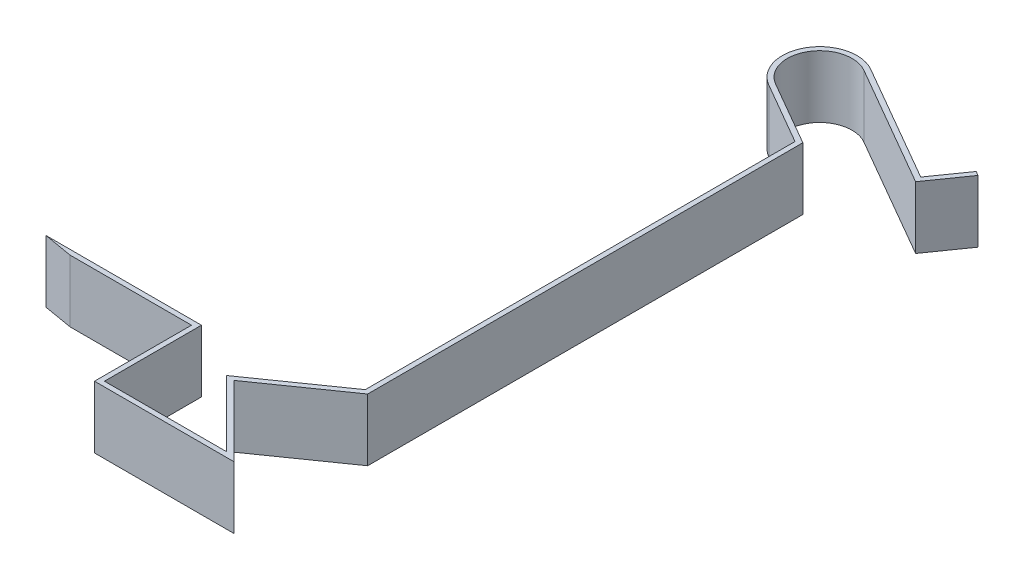
ISO-10303-21;
HEADER;
FILE_DESCRIPTION(('STEP AP214'),'2;1');
FILE_NAME('part.step','',(''),(''),'','','');
FILE_SCHEMA(('AUTOMOTIVE_DESIGN { 1 0 10303 214 1 1 1 1 }'));
ENDSEC;
DATA;
#1=APPLICATION_CONTEXT('core data for automotive mechanical design processes');
#2=APPLICATION_PROTOCOL_DEFINITION('international standard','automotive_design',2000,#1);
#3=PRODUCT_CONTEXT('',#1,'mechanical');
#4=PRODUCT('Part','Part','',(#3));
#5=PRODUCT_RELATED_PRODUCT_CATEGORY('part','',(#4));
#6=PRODUCT_DEFINITION_FORMATION('','',#4);
#7=PRODUCT_DEFINITION_CONTEXT('part definition',#1,'design');
#8=PRODUCT_DEFINITION('design','',#6,#7);
#9=PRODUCT_DEFINITION_SHAPE('','',#8);
#10=(LENGTH_UNIT() NAMED_UNIT(*) SI_UNIT(.MILLI.,.METRE.));
#11=(NAMED_UNIT(*) PLANE_ANGLE_UNIT() SI_UNIT($,.RADIAN.));
#12=(NAMED_UNIT(*) SI_UNIT($,.STERADIAN.) SOLID_ANGLE_UNIT());
#13=UNCERTAINTY_MEASURE_WITH_UNIT(LENGTH_MEASURE(1.E-05),#10,'distance_accuracy_value','');
#14=(GEOMETRIC_REPRESENTATION_CONTEXT(3) GLOBAL_UNCERTAINTY_ASSIGNED_CONTEXT((#13)) GLOBAL_UNIT_ASSIGNED_CONTEXT((#10,
#11,#12)) REPRESENTATION_CONTEXT('',''));
#15=CARTESIAN_POINT('',(0.,0.,0.));
#16=DIRECTION('',(0.,0.,1.));
#17=DIRECTION('',(1.,0.,0.));
#18=AXIS2_PLACEMENT_3D('',#15,#16,#17);
#19=CARTESIAN_POINT('',(-10.934737319455,2.5,-12.9348525920538));
#20=DIRECTION('',(0.168909576552276,0.,-0.985631551315668));
#21=DIRECTION('',(-0.985631551315668,0.,-0.168909576552276));
#22=AXIS2_PLACEMENT_3D('',#19,#20,#21);
#23=PLANE('',#22);
#24=DIRECTION('',(0.985631551315668,0.,0.168909576552276));
#25=VECTOR('',#24,1.);
#26=CARTESIAN_POINT('',(-10.934737319455,0.,-12.9348525920538));
#27=LINE('',#26,#25);
#28=CARTESIAN_POINT('',(-10.934737319455,0.,-12.9348525920538));
#29=VERTEX_POINT('',#28);
#30=CARTESIAN_POINT('',(-9.76768501675672,0.,-12.7348525920538));
#31=VERTEX_POINT('',#30);
#32=EDGE_CURVE('E225',#29,#31,#27,.T.);
#33=ORIENTED_EDGE('',*,*,#32,.T.);
#34=DIRECTION('',(0.,-1.,0.));
#35=VECTOR('',#34,1.);
#36=CARTESIAN_POINT('',(-9.76768501675672,2.5,-12.7348525920538));
#37=LINE('',#36,#35);
#38=CARTESIAN_POINT('',(-9.76768501675672,2.5,-12.7348525920538));
#39=VERTEX_POINT('',#38);
#40=EDGE_CURVE('E11',#39,#31,#37,.T.);
#41=ORIENTED_EDGE('',*,*,#40,.F.);
#42=DIRECTION('',(0.985631551315668,0.,0.168909576552276));
#43=VECTOR('',#42,1.);
#44=CARTESIAN_POINT('',(-10.934737319455,2.5,-12.9348525920538));
#45=LINE('',#44,#43);
#46=CARTESIAN_POINT('',(-10.934737319455,2.5,-12.9348525920538));
#47=VERTEX_POINT('',#46);
#48=EDGE_CURVE('E289',#47,#39,#45,.T.);
#49=ORIENTED_EDGE('',*,*,#48,.F.);
#50=DIRECTION('',(0.,-1.,0.));
#51=VECTOR('',#50,1.);
#52=CARTESIAN_POINT('',(-10.934737319455,2.5,-12.9348525920538));
#53=LINE('',#52,#51);
#54=EDGE_CURVE('E221',#47,#29,#53,.T.);
#55=ORIENTED_EDGE('',*,*,#54,.T.);
#56=EDGE_LOOP('',(#33,#41,#49,#55));
#57=FACE_BOUND('',#56,.T.);
#58=ADVANCED_FACE('F40',(#57),#23,.F.);
#59=CARTESIAN_POINT('',(-9.76768501675672,2.5,-12.7348525920538));
#60=DIRECTION('',(0.,0.,-1.));
#61=DIRECTION('',(-1.,0.,0.));
#62=AXIS2_PLACEMENT_3D('',#59,#60,#61);
#63=PLANE('',#62);
#64=DIRECTION('',(1.,0.,0.));
#65=VECTOR('',#64,1.);
#66=CARTESIAN_POINT('',(-9.76768501675672,0.,-12.7348525920538));
#67=LINE('',#66,#65);
#68=CARTESIAN_POINT('',(-4.88473731945503,0.,-12.7348525920538));
#69=VERTEX_POINT('',#68);
#70=EDGE_CURVE('E229',#31,#69,#67,.T.);
#71=ORIENTED_EDGE('',*,*,#70,.T.);
#72=DIRECTION('',(0.,-1.,0.));
#73=VECTOR('',#72,1.);
#74=CARTESIAN_POINT('',(-4.88473731945503,2.5,-12.7348525920538));
#75=LINE('',#74,#73);
#76=CARTESIAN_POINT('',(-4.88473731945503,2.5,-12.7348525920538));
#77=VERTEX_POINT('',#76);
#78=EDGE_CURVE('E49',#77,#69,#75,.T.);
#79=ORIENTED_EDGE('',*,*,#78,.F.);
#80=DIRECTION('',(1.,0.,0.));
#81=VECTOR('',#80,1.);
#82=CARTESIAN_POINT('',(-9.76768501675672,2.5,-12.7348525920538));
#83=LINE('',#82,#81);
#84=EDGE_CURVE('E142',#39,#77,#83,.T.);
#85=ORIENTED_EDGE('',*,*,#84,.F.);
#86=ORIENTED_EDGE('',*,*,#40,.T.);
#87=EDGE_LOOP('',(#71,#79,#85,#86));
#88=FACE_BOUND('',#87,.T.);
#89=ADVANCED_FACE('F453',(#88),#63,.F.);
#90=CARTESIAN_POINT('',(-4.88473731945503,2.5,-12.7348525920538));
#91=DIRECTION('',(1.,0.,0.));
#92=DIRECTION('',(0.,0.,-1.));
#93=AXIS2_PLACEMENT_3D('',#90,#91,#92);
#94=PLANE('',#93);
#95=DIRECTION('',(0.,0.,1.));
#96=VECTOR('',#95,1.);
#97=CARTESIAN_POINT('',(-4.88473731945503,0.,-12.7348525920538));
#98=LINE('',#97,#96);
#99=CARTESIAN_POINT('',(-4.88473731945503,0.,-8.83485259205379));
#100=VERTEX_POINT('',#99);
#101=EDGE_CURVE('E232',#69,#100,#98,.T.);
#102=ORIENTED_EDGE('',*,*,#101,.T.);
#103=DIRECTION('',(0.,-1.,0.));
#104=VECTOR('',#103,1.);
#105=CARTESIAN_POINT('',(-4.88473731945503,2.5,-8.83485259205379));
#106=LINE('',#105,#104);
#107=CARTESIAN_POINT('',(-4.88473731945503,2.5,-8.83485259205379));
#108=VERTEX_POINT('',#107);
#109=EDGE_CURVE('E356',#108,#100,#106,.T.);
#110=ORIENTED_EDGE('',*,*,#109,.F.);
#111=DIRECTION('',(0.,0.,1.));
#112=VECTOR('',#111,1.);
#113=CARTESIAN_POINT('',(-4.88473731945503,2.5,-12.7348525920538));
#114=LINE('',#113,#112);
#115=EDGE_CURVE('E366',#77,#108,#114,.T.);
#116=ORIENTED_EDGE('',*,*,#115,.F.);
#117=ORIENTED_EDGE('',*,*,#78,.T.);
#118=EDGE_LOOP('',(#102,#110,#116,#117));
#119=FACE_BOUND('',#118,.T.);
#120=ADVANCED_FACE('F364',(#119),#94,.F.);
#121=CARTESIAN_POINT('',(-4.88473731945503,2.5,-8.83485259205379));
#122=DIRECTION('',(0.,0.,-1.));
#123=DIRECTION('',(-1.,0.,0.));
#124=AXIS2_PLACEMENT_3D('',#121,#122,#123);
#125=PLANE('',#124);
#126=DIRECTION('',(1.,0.,0.));
#127=VECTOR('',#126,1.);
#128=CARTESIAN_POINT('',(-4.88473731945503,0.,-8.83485259205379));
#129=LINE('',#128,#127);
#130=CARTESIAN_POINT('',(0.715262680544972,0.,-8.83485259205378));
#131=VERTEX_POINT('',#130);
#132=EDGE_CURVE('E235',#100,#131,#129,.T.);
#133=ORIENTED_EDGE('',*,*,#132,.T.);
#134=DIRECTION('',(0.,-1.,0.));
#135=VECTOR('',#134,1.);
#136=CARTESIAN_POINT('',(0.715262680544972,2.5,-8.83485259205378));
#137=LINE('',#136,#135);
#138=CARTESIAN_POINT('',(0.715262680544972,2.5,-8.83485259205378));
#139=VERTEX_POINT('',#138);
#140=EDGE_CURVE('E352',#139,#131,#137,.T.);
#141=ORIENTED_EDGE('',*,*,#140,.F.);
#142=DIRECTION('',(1.,0.,0.));
#143=VECTOR('',#142,1.);
#144=CARTESIAN_POINT('',(-4.88473731945503,2.5,-8.83485259205379));
#145=LINE('',#144,#143);
#146=EDGE_CURVE('E385',#108,#139,#145,.T.);
#147=ORIENTED_EDGE('',*,*,#146,.F.);
#148=ORIENTED_EDGE('',*,*,#109,.T.);
#149=EDGE_LOOP('',(#133,#141,#147,#148));
#150=FACE_BOUND('',#149,.T.);
#151=ADVANCED_FACE('F375',(#150),#125,.F.);
#152=CARTESIAN_POINT('',(0.715262680544972,2.5,-8.83485259205378));
#153=DIRECTION('',(-0.707106781186544,0.,0.707106781186551));
#154=DIRECTION('',(0.707106781186551,0.,0.707106781186544));
#155=AXIS2_PLACEMENT_3D('',#152,#153,#154);
#156=PLANE('',#155);
#157=DIRECTION('',(-0.707106781186551,0.,-0.707106781186544));
#158=VECTOR('',#157,1.);
#159=CARTESIAN_POINT('',(0.715262680544972,0.,-8.83485259205378));
#160=LINE('',#159,#158);
#161=CARTESIAN_POINT('',(-2.11316444420123,0.,-11.6632797168));
#162=VERTEX_POINT('',#161);
#163=EDGE_CURVE('E238',#131,#162,#160,.T.);
#164=ORIENTED_EDGE('',*,*,#163,.T.);
#165=DIRECTION('',(0.,-1.,0.));
#166=VECTOR('',#165,1.);
#167=CARTESIAN_POINT('',(-2.11316444420123,2.5,-11.6632797168));
#168=LINE('',#167,#166);
#169=CARTESIAN_POINT('',(-2.11316444420123,2.5,-11.6632797168));
#170=VERTEX_POINT('',#169);
#171=EDGE_CURVE('E348',#170,#162,#168,.T.);
#172=ORIENTED_EDGE('',*,*,#171,.F.);
#173=DIRECTION('',(-0.707106781186551,0.,-0.707106781186544));
#174=VECTOR('',#173,1.);
#175=CARTESIAN_POINT('',(0.715262680544972,2.5,-8.83485259205378));
#176=LINE('',#175,#174);
#177=EDGE_CURVE('E381',#139,#170,#176,.T.);
#178=ORIENTED_EDGE('',*,*,#177,.F.);
#179=ORIENTED_EDGE('',*,*,#140,.T.);
#180=EDGE_LOOP('',(#164,#172,#178,#179));
#181=FACE_BOUND('',#180,.T.);
#182=ADVANCED_FACE('F379',(#181),#156,.F.);
#183=CARTESIAN_POINT('',(1.05348296735205,2.5,-13.8805901052219));
#184=DIRECTION('',(-0.573576436351053,0.,-0.819152044288987));
#185=DIRECTION('',(-0.819152044288987,0.,0.573576436351053));
#186=AXIS2_PLACEMENT_3D('',#183,#184,#185);
#187=PLANE('',#186);
#188=DIRECTION('',(0.819152044288987,0.,-0.573576436351053));
#189=VECTOR('',#188,1.);
#190=CARTESIAN_POINT('',(1.05348296735205,0.,-13.8805901052219));
#191=LINE('',#190,#189);
#192=CARTESIAN_POINT('',(1.05348296735205,0.,-13.8805901052219));
#193=VERTEX_POINT('',#192);
#194=EDGE_CURVE('E241',#162,#193,#191,.T.);
#195=ORIENTED_EDGE('',*,*,#194,.T.);
#196=DIRECTION('',(0.,-1.,0.));
#197=VECTOR('',#196,1.);
#198=CARTESIAN_POINT('',(1.05348296735205,2.5,-13.8805901052219));
#199=LINE('',#198,#197);
#200=CARTESIAN_POINT('',(1.05348296735205,2.5,-13.8805901052219));
#201=VERTEX_POINT('',#200);
#202=EDGE_CURVE('E344',#201,#193,#199,.T.);
#203=ORIENTED_EDGE('',*,*,#202,.F.);
#204=DIRECTION('',(0.819152044288987,0.,-0.573576436351053));
#205=VECTOR('',#204,1.);
#206=CARTESIAN_POINT('',(1.05348296735205,2.5,-13.8805901052219));
#207=LINE('',#206,#205);
#208=EDGE_CURVE('E384',#170,#201,#207,.T.);
#209=ORIENTED_EDGE('',*,*,#208,.F.);
#210=ORIENTED_EDGE('',*,*,#171,.T.);
#211=EDGE_LOOP('',(#195,#203,#209,#210));
#212=FACE_BOUND('',#211,.T.);
#213=ADVANCED_FACE('F466',(#212),#187,.F.);
#214=CARTESIAN_POINT('',(1.05348296735204,2.5,-31.3805901052219));
#215=DIRECTION('',(-1.,0.,0.));
#216=DIRECTION('',(0.,0.,1.));
#217=AXIS2_PLACEMENT_3D('',#214,#215,#216);
#218=PLANE('',#217);
#219=DIRECTION('',(0.,0.,-1.));
#220=VECTOR('',#219,1.);
#221=CARTESIAN_POINT('',(1.05348296735204,0.,-31.3805901052219));
#222=LINE('',#221,#220);
#223=CARTESIAN_POINT('',(1.05348296735204,0.,-31.3805901052219));
#224=VERTEX_POINT('',#223);
#225=EDGE_CURVE('E244',#193,#224,#222,.T.);
#226=ORIENTED_EDGE('',*,*,#225,.T.);
#227=DIRECTION('',(0.,-1.,0.));
#228=VECTOR('',#227,1.);
#229=CARTESIAN_POINT('',(1.05348296735204,2.5,-31.3805901052219));
#230=LINE('',#229,#228);
#231=CARTESIAN_POINT('',(1.05348296735204,2.5,-31.3805901052219));
#232=VERTEX_POINT('',#231);
#233=EDGE_CURVE('E340',#232,#224,#230,.T.);
#234=ORIENTED_EDGE('',*,*,#233,.F.);
#235=DIRECTION('',(0.,0.,-1.));
#236=VECTOR('',#235,1.);
#237=CARTESIAN_POINT('',(1.05348296735204,2.5,-31.3805901052219));
#238=LINE('',#237,#236);
#239=EDGE_CURVE('E389',#201,#232,#238,.T.);
#240=ORIENTED_EDGE('',*,*,#239,.F.);
#241=ORIENTED_EDGE('',*,*,#202,.T.);
#242=EDGE_LOOP('',(#226,#234,#240,#241));
#243=FACE_BOUND('',#242,.T.);
#244=ADVANCED_FACE('F469',(#243),#218,.F.);
#245=CARTESIAN_POINT('',(1.05348296735204,2.5,-31.3805901052219));
#246=DIRECTION('',(-0.5,0.,0.866025403784439));
#247=DIRECTION('',(0.866025403784439,0.,0.5));
#248=AXIS2_PLACEMENT_3D('',#245,#246,#247);
#249=PLANE('',#248);
#250=DIRECTION('',(-0.866025403784439,0.,-0.5));
#251=VECTOR('',#250,1.);
#252=CARTESIAN_POINT('',(1.05348296735204,0.,-31.3805901052219));
#253=LINE('',#252,#251);
#254=CARTESIAN_POINT('',(-1.54459324400127,0.,-32.8805901052219));
#255=VERTEX_POINT('',#254);
#256=EDGE_CURVE('E247',#224,#255,#253,.T.);
#257=ORIENTED_EDGE('',*,*,#256,.T.);
#258=DIRECTION('',(0.,-1.,0.));
#259=VECTOR('',#258,1.);
#260=CARTESIAN_POINT('',(-1.54459324400127,2.5,-32.8805901052219));
#261=LINE('',#260,#259);
#262=CARTESIAN_POINT('',(-1.54459324400127,2.5,-32.8805901052219));
#263=VERTEX_POINT('',#262);
#264=EDGE_CURVE('E336',#263,#255,#261,.T.);
#265=ORIENTED_EDGE('',*,*,#264,.F.);
#266=DIRECTION('',(-0.866025403784439,0.,-0.5));
#267=VECTOR('',#266,1.);
#268=CARTESIAN_POINT('',(1.05348296735204,2.5,-31.3805901052219));
#269=LINE('',#268,#267);
#270=EDGE_CURVE('E396',#232,#263,#269,.T.);
#271=ORIENTED_EDGE('',*,*,#270,.F.);
#272=ORIENTED_EDGE('',*,*,#233,.T.);
#273=EDGE_LOOP('',(#257,#265,#271,#272));
#274=FACE_BOUND('',#273,.T.);
#275=ADVANCED_FACE('F473',(#274),#249,.F.);
#276=CARTESIAN_POINT('',(-0.894593244001279,2.5,-34.0064231301416));
#277=DIRECTION('',(0.,-1.,0.));
#278=DIRECTION('',(0.,0.,-1.));
#279=AXIS2_PLACEMENT_3D('',#276,#277,#278);
#280=CYLINDRICAL_SURFACE('',#279,1.3);
#281=CARTESIAN_POINT('',(-0.894593244001279,0.,-34.0064231301416));
#282=DIRECTION('',(0.,-1.,0.));
#283=DIRECTION('',(0.,0.,1.));
#284=AXIS2_PLACEMENT_3D('',#281,#282,#283);
#285=CIRCLE('',#284,1.3);
#286=CARTESIAN_POINT('',(-0.24459324400128,0.,-35.1322561550614));
#287=VERTEX_POINT('',#286);
#288=EDGE_CURVE('E250',#255,#287,#285,.T.);
#289=ORIENTED_EDGE('',*,*,#288,.T.);
#290=DIRECTION('',(0.,-1.,0.));
#291=VECTOR('',#290,1.);
#292=CARTESIAN_POINT('',(-0.24459324400128,2.5,-35.1322561550614));
#293=LINE('',#292,#291);
#294=CARTESIAN_POINT('',(-0.24459324400128,2.5,-35.1322561550614));
#295=VERTEX_POINT('',#294);
#296=EDGE_CURVE('E332',#295,#287,#293,.T.);
#297=ORIENTED_EDGE('',*,*,#296,.F.);
#298=CARTESIAN_POINT('',(-0.894593244001279,2.5,-34.0064231301416));
#299=DIRECTION('',(0.,-1.,0.));
#300=DIRECTION('',(0.,0.,1.));
#301=AXIS2_PLACEMENT_3D('',#298,#299,#300);
#302=CIRCLE('',#301,1.3);
#303=EDGE_CURVE('E399',#263,#295,#302,.T.);
#304=ORIENTED_EDGE('',*,*,#303,.F.);
#305=ORIENTED_EDGE('',*,*,#264,.T.);
#306=EDGE_LOOP('',(#289,#297,#304,#305));
#307=FACE_BOUND('',#306,.T.);
#308=ADVANCED_FACE('F477',(#307),#280,.F.);
#309=CARTESIAN_POINT('',(-0.24459324400128,2.5,-35.1322561550614));
#310=DIRECTION('',(0.499999999999998,0.,-0.86602540378444));
#311=DIRECTION('',(-0.86602540378444,0.,-0.499999999999998));
#312=AXIS2_PLACEMENT_3D('',#309,#310,#311);
#313=PLANE('',#312);
#314=DIRECTION('',(0.86602540378444,0.,0.499999999999998));
#315=VECTOR('',#314,1.);
#316=CARTESIAN_POINT('',(-0.24459324400128,0.,-35.1322561550614));
#317=LINE('',#316,#315);
#318=CARTESIAN_POINT('',(4.67698341876659,0.,-32.290782543975));
#319=VERTEX_POINT('',#318);
#320=EDGE_CURVE('E253',#287,#319,#317,.T.);
#321=ORIENTED_EDGE('',*,*,#320,.T.);
#322=DIRECTION('',(0.,-1.,0.));
#323=VECTOR('',#322,1.);
#324=CARTESIAN_POINT('',(4.67698341876659,2.5,-32.290782543975));
#325=LINE('',#324,#323);
#326=CARTESIAN_POINT('',(4.67698341876659,2.5,-32.290782543975));
#327=VERTEX_POINT('',#326);
#328=EDGE_CURVE('E328',#327,#319,#325,.T.);
#329=ORIENTED_EDGE('',*,*,#328,.F.);
#330=DIRECTION('',(0.86602540378444,0.,0.499999999999998));
#331=VECTOR('',#330,1.);
#332=CARTESIAN_POINT('',(-0.24459324400128,2.5,-35.1322561550614));
#333=LINE('',#332,#331);
#334=EDGE_CURVE('E402',#295,#327,#333,.T.);
#335=ORIENTED_EDGE('',*,*,#334,.F.);
#336=ORIENTED_EDGE('',*,*,#296,.T.);
#337=EDGE_LOOP('',(#321,#329,#335,#336));
#338=FACE_BOUND('',#337,.T.);
#339=ADVANCED_FACE('F481',(#338),#313,.F.);
#340=CARTESIAN_POINT('',(4.67698341876659,2.5,-32.290782543975));
#341=DIRECTION('',(-0.818155391998388,0.,-0.57499717785739));
#342=DIRECTION('',(-0.57499717785739,0.,0.818155391998388));
#343=AXIS2_PLACEMENT_3D('',#340,#341,#342);
#344=PLANE('',#343);
#345=DIRECTION('',(0.57499717785739,0.,-0.818155391998388));
#346=VECTOR('',#345,1.);
#347=CARTESIAN_POINT('',(4.67698341876659,0.,-32.290782543975));
#348=LINE('',#347,#346);
#349=CARTESIAN_POINT('',(5.7124353220374,0.,-33.7641124844328));
#350=VERTEX_POINT('',#349);
#351=EDGE_CURVE('E256',#319,#350,#348,.T.);
#352=ORIENTED_EDGE('',*,*,#351,.T.);
#353=DIRECTION('',(0.,-1.,0.));
#354=VECTOR('',#353,1.);
#355=CARTESIAN_POINT('',(5.7124353220374,2.5,-33.7641124844328));
#356=LINE('',#355,#354);
#357=CARTESIAN_POINT('',(5.7124353220374,2.5,-33.7641124844328));
#358=VERTEX_POINT('',#357);
#359=EDGE_CURVE('E324',#358,#350,#356,.T.);
#360=ORIENTED_EDGE('',*,*,#359,.F.);
#361=DIRECTION('',(0.57499717785739,0.,-0.818155391998388));
#362=VECTOR('',#361,1.);
#363=CARTESIAN_POINT('',(4.67698341876659,2.5,-32.290782543975));
#364=LINE('',#363,#362);
#365=EDGE_CURVE('E405',#327,#358,#364,.T.);
#366=ORIENTED_EDGE('',*,*,#365,.F.);
#367=ORIENTED_EDGE('',*,*,#328,.T.);
#368=EDGE_LOOP('',(#352,#360,#366,#367));
#369=FACE_BOUND('',#368,.T.);
#370=ADVANCED_FACE('F485',(#369),#344,.F.);
#371=CARTESIAN_POINT('',(5.53854196138497,2.5,-33.8645098630157));
#372=DIRECTION('',(-0.499999999999986,0.,0.866025403784446));
#373=DIRECTION('',(0.866025403784446,0.,0.499999999999986));
#374=AXIS2_PLACEMENT_3D('',#371,#372,#373);
#375=PLANE('',#374);
#376=DIRECTION('',(-0.866025403784446,0.,-0.499999999999986));
#377=VECTOR('',#376,1.);
#378=CARTESIAN_POINT('',(5.53854196138497,0.,-33.8645098630157));
#379=LINE('',#378,#377);
#380=CARTESIAN_POINT('',(5.53854196138497,0.,-33.8645098630157));
#381=VERTEX_POINT('',#380);
#382=EDGE_CURVE('E259',#350,#381,#379,.T.);
#383=ORIENTED_EDGE('',*,*,#382,.T.);
#384=DIRECTION('',(0.,-1.,0.));
#385=VECTOR('',#384,1.);
#386=CARTESIAN_POINT('',(5.53854196138497,2.5,-33.8645098630157));
#387=LINE('',#386,#385);
#388=CARTESIAN_POINT('',(5.53854196138497,2.5,-33.8645098630157));
#389=VERTEX_POINT('',#388);
#390=EDGE_CURVE('E320',#389,#381,#387,.T.);
#391=ORIENTED_EDGE('',*,*,#390,.F.);
#392=DIRECTION('',(-0.866025403784446,0.,-0.499999999999986));
#393=VECTOR('',#392,1.);
#394=CARTESIAN_POINT('',(5.53854196138497,2.5,-33.8645098630157));
#395=LINE('',#394,#393);
#396=EDGE_CURVE('E408',#358,#389,#395,.T.);
#397=ORIENTED_EDGE('',*,*,#396,.F.);
#398=ORIENTED_EDGE('',*,*,#359,.T.);
#399=EDGE_LOOP('',(#383,#391,#397,#398));
#400=FACE_BOUND('',#399,.T.);
#401=ADVANCED_FACE('F489',(#400),#375,.F.);
#402=CARTESIAN_POINT('',(4.61854647681314,2.5,-32.5554612358183));
#403=DIRECTION('',(0.818155391998386,0.,0.574997177857393));
#404=DIRECTION('',(0.574997177857393,0.,-0.818155391998386));
#405=AXIS2_PLACEMENT_3D('',#402,#403,#404);
#406=PLANE('',#405);
#407=DIRECTION('',(-0.574997177857393,0.,0.818155391998386));
#408=VECTOR('',#407,1.);
#409=CARTESIAN_POINT('',(4.61854647681314,0.,-32.5554612358183));
#410=LINE('',#409,#408);
#411=CARTESIAN_POINT('',(4.61854647681314,0.,-32.5554612358183));
#412=VERTEX_POINT('',#411);
#413=EDGE_CURVE('E262',#381,#412,#410,.T.);
#414=ORIENTED_EDGE('',*,*,#413,.T.);
#415=DIRECTION('',(0.,-1.,0.));
#416=VECTOR('',#415,1.);
#417=CARTESIAN_POINT('',(4.61854647681314,2.5,-32.5554612358183));
#418=LINE('',#417,#416);
#419=CARTESIAN_POINT('',(4.61854647681314,2.5,-32.5554612358183));
#420=VERTEX_POINT('',#419);
#421=EDGE_CURVE('E316',#420,#412,#418,.T.);
#422=ORIENTED_EDGE('',*,*,#421,.F.);
#423=DIRECTION('',(-0.574997177857393,0.,0.818155391998386));
#424=VECTOR('',#423,1.);
#425=CARTESIAN_POINT('',(4.61854647681314,2.5,-32.5554612358183));
#426=LINE('',#425,#424);
#427=EDGE_CURVE('E411',#389,#420,#426,.T.);
#428=ORIENTED_EDGE('',*,*,#427,.F.);
#429=ORIENTED_EDGE('',*,*,#390,.T.);
#430=EDGE_LOOP('',(#414,#422,#428,#429));
#431=FACE_BOUND('',#430,.T.);
#432=ADVANCED_FACE('F493',(#431),#406,.F.);
#433=CARTESIAN_POINT('',(-0.144593244001279,2.5,-35.3054612358183));
#434=DIRECTION('',(-0.499999999999998,0.,0.86602540378444));
#435=DIRECTION('',(0.86602540378444,0.,0.499999999999998));
#436=AXIS2_PLACEMENT_3D('',#433,#434,#435);
#437=PLANE('',#436);
#438=DIRECTION('',(-0.86602540378444,0.,-0.499999999999998));
#439=VECTOR('',#438,1.);
#440=CARTESIAN_POINT('',(-0.144593244001279,0.,-35.3054612358183));
#441=LINE('',#440,#439);
#442=CARTESIAN_POINT('',(-0.144593244001278,0.,-35.3054612358183));
#443=VERTEX_POINT('',#442);
#444=EDGE_CURVE('E265',#412,#443,#441,.T.);
#445=ORIENTED_EDGE('',*,*,#444,.T.);
#446=DIRECTION('',(0.,-1.,0.));
#447=VECTOR('',#446,1.);
#448=CARTESIAN_POINT('',(-0.144593244001278,2.5,-35.3054612358183));
#449=LINE('',#448,#447);
#450=CARTESIAN_POINT('',(-0.144593244001278,2.5,-35.3054612358183));
#451=VERTEX_POINT('',#450);
#452=EDGE_CURVE('E312',#451,#443,#449,.T.);
#453=ORIENTED_EDGE('',*,*,#452,.F.);
#454=DIRECTION('',(-0.86602540378444,0.,-0.499999999999998));
#455=VECTOR('',#454,1.);
#456=CARTESIAN_POINT('',(-0.144593244001279,2.5,-35.3054612358183));
#457=LINE('',#456,#455);
#458=EDGE_CURVE('E414',#420,#451,#457,.T.);
#459=ORIENTED_EDGE('',*,*,#458,.F.);
#460=ORIENTED_EDGE('',*,*,#421,.T.);
#461=EDGE_LOOP('',(#445,#453,#459,#460));
#462=FACE_BOUND('',#461,.T.);
#463=ADVANCED_FACE('F497',(#462),#437,.F.);
#464=CARTESIAN_POINT('',(-0.894593244001279,2.5,-34.0064231301416));
#465=DIRECTION('',(0.,-1.,0.));
#466=DIRECTION('',(0.,0.,-1.));
#467=AXIS2_PLACEMENT_3D('',#464,#465,#466);
#468=CYLINDRICAL_SURFACE('',#467,1.5);
#469=CARTESIAN_POINT('',(-0.894593244001279,0.,-34.0064231301416));
#470=DIRECTION('',(0.,1.,0.));
#471=DIRECTION('',(0.,0.,-1.));
#472=AXIS2_PLACEMENT_3D('',#469,#470,#471);
#473=CIRCLE('',#472,1.5);
#474=CARTESIAN_POINT('',(-1.64459324400127,0.,-32.707385024465));
#475=VERTEX_POINT('',#474);
#476=EDGE_CURVE('E268',#443,#475,#473,.T.);
#477=ORIENTED_EDGE('',*,*,#476,.T.);
#478=DIRECTION('',(0.,-1.,0.));
#479=VECTOR('',#478,1.);
#480=CARTESIAN_POINT('',(-1.64459324400127,2.5,-32.707385024465));
#481=LINE('',#480,#479);
#482=CARTESIAN_POINT('',(-1.64459324400127,2.5,-32.707385024465));
#483=VERTEX_POINT('',#482);
#484=EDGE_CURVE('E308',#483,#475,#481,.T.);
#485=ORIENTED_EDGE('',*,*,#484,.F.);
#486=CARTESIAN_POINT('',(-0.894593244001279,2.5,-34.0064231301416));
#487=DIRECTION('',(0.,1.,0.));
#488=DIRECTION('',(0.,0.,-1.));
#489=AXIS2_PLACEMENT_3D('',#486,#487,#488);
#490=CIRCLE('',#489,1.5);
#491=EDGE_CURVE('E417',#451,#483,#490,.T.);
#492=ORIENTED_EDGE('',*,*,#491,.F.);
#493=ORIENTED_EDGE('',*,*,#452,.T.);
#494=EDGE_LOOP('',(#477,#485,#492,#493));
#495=FACE_BOUND('',#494,.T.);
#496=ADVANCED_FACE('F501',(#495),#468,.T.);
#497=CARTESIAN_POINT('',(-1.64459324400127,2.5,-32.707385024465));
#498=DIRECTION('',(0.499999999999997,0.,-0.86602540378444));
#499=DIRECTION('',(-0.86602540378444,0.,-0.499999999999997));
#500=AXIS2_PLACEMENT_3D('',#497,#498,#499);
#501=PLANE('',#500);
#502=DIRECTION('',(0.86602540378444,0.,0.499999999999997));
#503=VECTOR('',#502,1.);
#504=CARTESIAN_POINT('',(-1.64459324400127,0.,-32.707385024465));
#505=LINE('',#504,#503);
#506=CARTESIAN_POINT('',(0.853482967352041,0.,-31.265120051384));
#507=VERTEX_POINT('',#506);
#508=EDGE_CURVE('E271',#475,#507,#505,.T.);
#509=ORIENTED_EDGE('',*,*,#508,.T.);
#510=DIRECTION('',(0.,-1.,0.));
#511=VECTOR('',#510,1.);
#512=CARTESIAN_POINT('',(0.853482967352041,2.5,-31.265120051384));
#513=LINE('',#512,#511);
#514=CARTESIAN_POINT('',(0.853482967352041,2.5,-31.265120051384));
#515=VERTEX_POINT('',#514);
#516=EDGE_CURVE('E304',#515,#507,#513,.T.);
#517=ORIENTED_EDGE('',*,*,#516,.F.);
#518=DIRECTION('',(0.86602540378444,0.,0.499999999999997));
#519=VECTOR('',#518,1.);
#520=CARTESIAN_POINT('',(-1.64459324400127,2.5,-32.707385024465));
#521=LINE('',#520,#519);
#522=EDGE_CURVE('E420',#483,#515,#521,.T.);
#523=ORIENTED_EDGE('',*,*,#522,.F.);
#524=ORIENTED_EDGE('',*,*,#484,.T.);
#525=EDGE_LOOP('',(#509,#517,#523,#524));
#526=FACE_BOUND('',#525,.T.);
#527=ADVANCED_FACE('F505',(#526),#501,.F.);
#528=CARTESIAN_POINT('',(0.853482967352046,2.5,-13.9847035153322));
#529=DIRECTION('',(1.,0.,0.));
#530=DIRECTION('',(0.,0.,-1.));
#531=AXIS2_PLACEMENT_3D('',#528,#529,#530);
#532=PLANE('',#531);
#533=DIRECTION('',(0.,0.,1.));
#534=VECTOR('',#533,1.);
#535=CARTESIAN_POINT('',(0.853482967352046,0.,-13.9847035153322));
#536=LINE('',#535,#534);
#537=CARTESIAN_POINT('',(0.853482967352046,0.,-13.9847035153322));
#538=VERTEX_POINT('',#537);
#539=EDGE_CURVE('E274',#507,#538,#536,.T.);
#540=ORIENTED_EDGE('',*,*,#539,.T.);
#541=DIRECTION('',(0.,-1.,0.));
#542=VECTOR('',#541,1.);
#543=CARTESIAN_POINT('',(0.853482967352046,2.5,-13.9847035153322));
#544=LINE('',#543,#542);
#545=CARTESIAN_POINT('',(0.853482967352046,2.5,-13.9847035153322));
#546=VERTEX_POINT('',#545);
#547=EDGE_CURVE('E300',#546,#538,#544,.T.);
#548=ORIENTED_EDGE('',*,*,#547,.F.);
#549=DIRECTION('',(0.,0.,1.));
#550=VECTOR('',#549,1.);
#551=CARTESIAN_POINT('',(0.853482967352046,2.5,-13.9847035153322));
#552=LINE('',#551,#550);
#553=EDGE_CURVE('E423',#515,#546,#552,.T.);
#554=ORIENTED_EDGE('',*,*,#553,.F.);
#555=ORIENTED_EDGE('',*,*,#516,.T.);
#556=EDGE_LOOP('',(#540,#548,#554,#555));
#557=FACE_BOUND('',#556,.T.);
#558=ADVANCED_FACE('F509',(#557),#532,.F.);
#559=CARTESIAN_POINT('',(-2.4231252098039,2.5,-11.690397769928));
#560=DIRECTION('',(0.573576436351053,0.,0.819152044288987));
#561=DIRECTION('',(0.819152044288987,0.,-0.573576436351053));
#562=AXIS2_PLACEMENT_3D('',#559,#560,#561);
#563=PLANE('',#562);
#564=DIRECTION('',(-0.819152044288987,0.,0.573576436351053));
#565=VECTOR('',#564,1.);
#566=CARTESIAN_POINT('',(-2.4231252098039,0.,-11.690397769928));
#567=LINE('',#566,#565);
#568=CARTESIAN_POINT('',(-2.4231252098039,0.,-11.690397769928));
#569=VERTEX_POINT('',#568);
#570=EDGE_CURVE('E277',#538,#569,#567,.T.);
#571=ORIENTED_EDGE('',*,*,#570,.T.);
#572=DIRECTION('',(0.,-1.,0.));
#573=VECTOR('',#572,1.);
#574=CARTESIAN_POINT('',(-2.4231252098039,2.5,-11.690397769928));
#575=LINE('',#574,#573);
#576=CARTESIAN_POINT('',(-2.4231252098039,2.5,-11.690397769928));
#577=VERTEX_POINT('',#576);
#578=EDGE_CURVE('E296',#577,#569,#575,.T.);
#579=ORIENTED_EDGE('',*,*,#578,.F.);
#580=DIRECTION('',(-0.819152044288987,0.,0.573576436351053));
#581=VECTOR('',#580,1.);
#582=CARTESIAN_POINT('',(-2.4231252098039,2.5,-11.690397769928));
#583=LINE('',#582,#581);
#584=EDGE_CURVE('E426',#546,#577,#583,.T.);
#585=ORIENTED_EDGE('',*,*,#584,.F.);
#586=ORIENTED_EDGE('',*,*,#547,.T.);
#587=EDGE_LOOP('',(#571,#579,#585,#586));
#588=FACE_BOUND('',#587,.T.);
#589=ADVANCED_FACE('F434',(#588),#563,.F.);
#590=CARTESIAN_POINT('',(0.232419968070351,2.5,-9.03485259205378));
#591=DIRECTION('',(0.707106781186546,0.,-0.707106781186549));
#592=DIRECTION('',(-0.707106781186549,0.,-0.707106781186546));
#593=AXIS2_PLACEMENT_3D('',#590,#591,#592);
#594=PLANE('',#593);
#595=DIRECTION('',(0.707106781186549,0.,0.707106781186546));
#596=VECTOR('',#595,1.);
#597=CARTESIAN_POINT('',(0.232419968070351,0.,-9.03485259205378));
#598=LINE('',#597,#596);
#599=CARTESIAN_POINT('',(0.232419968070351,0.,-9.03485259205378));
#600=VERTEX_POINT('',#599);
#601=EDGE_CURVE('E280',#569,#600,#598,.T.);
#602=ORIENTED_EDGE('',*,*,#601,.T.);
#603=DIRECTION('',(0.,-1.,0.));
#604=VECTOR('',#603,1.);
#605=CARTESIAN_POINT('',(0.232419968070351,2.5,-9.03485259205378));
#606=LINE('',#605,#604);
#607=CARTESIAN_POINT('',(0.232419968070351,2.5,-9.03485259205378));
#608=VERTEX_POINT('',#607);
#609=EDGE_CURVE('E214',#608,#600,#606,.T.);
#610=ORIENTED_EDGE('',*,*,#609,.F.);
#611=DIRECTION('',(0.707106781186549,0.,0.707106781186546));
#612=VECTOR('',#611,1.);
#613=CARTESIAN_POINT('',(0.232419968070351,2.5,-9.03485259205378));
#614=LINE('',#613,#612);
#615=EDGE_CURVE('E203',#577,#608,#614,.T.);
#616=ORIENTED_EDGE('',*,*,#615,.F.);
#617=ORIENTED_EDGE('',*,*,#578,.T.);
#618=EDGE_LOOP('',(#602,#610,#616,#617));
#619=FACE_BOUND('',#618,.T.);
#620=ADVANCED_FACE('F438',(#619),#594,.F.);
#621=CARTESIAN_POINT('',(-4.68473731945503,2.5,-9.03485259205379));
#622=DIRECTION('',(0.,0.,1.));
#623=DIRECTION('',(1.,0.,0.));
#624=AXIS2_PLACEMENT_3D('',#621,#622,#623);
#625=PLANE('',#624);
#626=DIRECTION('',(-1.,0.,0.));
#627=VECTOR('',#626,1.);
#628=CARTESIAN_POINT('',(-4.68473731945503,0.,-9.03485259205379));
#629=LINE('',#628,#627);
#630=CARTESIAN_POINT('',(-4.68473731945503,0.,-9.03485259205379));
#631=VERTEX_POINT('',#630);
#632=EDGE_CURVE('E212',#600,#631,#629,.T.);
#633=ORIENTED_EDGE('',*,*,#632,.T.);
#634=DIRECTION('',(0.,-1.,0.));
#635=VECTOR('',#634,1.);
#636=CARTESIAN_POINT('',(-4.68473731945503,2.5,-9.03485259205379));
#637=LINE('',#636,#635);
#638=CARTESIAN_POINT('',(-4.68473731945503,2.5,-9.03485259205379));
#639=VERTEX_POINT('',#638);
#640=EDGE_CURVE('E209',#639,#631,#637,.T.);
#641=ORIENTED_EDGE('',*,*,#640,.F.);
#642=DIRECTION('',(-1.,0.,0.));
#643=VECTOR('',#642,1.);
#644=CARTESIAN_POINT('',(-4.68473731945503,2.5,-9.03485259205379));
#645=LINE('',#644,#643);
#646=EDGE_CURVE('E197',#608,#639,#645,.T.);
#647=ORIENTED_EDGE('',*,*,#646,.F.);
#648=ORIENTED_EDGE('',*,*,#609,.T.);
#649=EDGE_LOOP('',(#633,#641,#647,#648));
#650=FACE_BOUND('',#649,.T.);
#651=ADVANCED_FACE('F210',(#650),#625,.F.);
#652=CARTESIAN_POINT('',(-4.68473731945503,2.5,-12.9348525920538));
#653=DIRECTION('',(-1.,0.,0.));
#654=DIRECTION('',(0.,0.,1.));
#655=AXIS2_PLACEMENT_3D('',#652,#653,#654);
#656=PLANE('',#655);
#657=DIRECTION('',(0.,0.,-1.));
#658=VECTOR('',#657,1.);
#659=CARTESIAN_POINT('',(-4.68473731945503,0.,-12.9348525920538));
#660=LINE('',#659,#658);
#661=CARTESIAN_POINT('',(-4.68473731945503,0.,-12.9348525920538));
#662=VERTEX_POINT('',#661);
#663=EDGE_CURVE('E128',#631,#662,#660,.T.);
#664=ORIENTED_EDGE('',*,*,#663,.T.);
#665=DIRECTION('',(0.,-1.,0.));
#666=VECTOR('',#665,1.);
#667=CARTESIAN_POINT('',(-4.68473731945503,2.5,-12.9348525920538));
#668=LINE('',#667,#666);
#669=CARTESIAN_POINT('',(-4.68473731945503,2.5,-12.9348525920538));
#670=VERTEX_POINT('',#669);
#671=EDGE_CURVE('E215',#670,#662,#668,.T.);
#672=ORIENTED_EDGE('',*,*,#671,.F.);
#673=DIRECTION('',(0.,0.,-1.));
#674=VECTOR('',#673,1.);
#675=CARTESIAN_POINT('',(-4.68473731945503,2.5,-12.9348525920538));
#676=LINE('',#675,#674);
#677=EDGE_CURVE('E201',#639,#670,#676,.T.);
#678=ORIENTED_EDGE('',*,*,#677,.F.);
#679=ORIENTED_EDGE('',*,*,#640,.T.);
#680=EDGE_LOOP('',(#664,#672,#678,#679));
#681=FACE_BOUND('',#680,.T.);
#682=ADVANCED_FACE('F217',(#681),#656,.F.);
#683=CARTESIAN_POINT('',(-10.934737319455,2.5,-12.9348525920538));
#684=DIRECTION('',(0.,0.,1.));
#685=DIRECTION('',(1.,0.,0.));
#686=AXIS2_PLACEMENT_3D('',#683,#684,#685);
#687=PLANE('',#686);
#688=DIRECTION('',(-1.,0.,0.));
#689=VECTOR('',#688,1.);
#690=CARTESIAN_POINT('',(-10.934737319455,0.,-12.9348525920538));
#691=LINE('',#690,#689);
#692=EDGE_CURVE('E134',#662,#29,#691,.T.);
#693=ORIENTED_EDGE('',*,*,#692,.T.);
#694=ORIENTED_EDGE('',*,*,#54,.F.);
#695=DIRECTION('',(-1.,0.,0.));
#696=VECTOR('',#695,1.);
#697=CARTESIAN_POINT('',(-10.934737319455,2.5,-12.9348525920538));
#698=LINE('',#697,#696);
#699=EDGE_CURVE('E57',#670,#47,#698,.T.);
#700=ORIENTED_EDGE('',*,*,#699,.F.);
#701=ORIENTED_EDGE('',*,*,#671,.T.);
#702=EDGE_LOOP('',(#693,#694,#700,#701));
#703=FACE_BOUND('',#702,.T.);
#704=ADVANCED_FACE('F442',(#703),#687,.F.);
#705=CARTESIAN_POINT('',(-0.894593244001279,2.5,-34.0064231301416));
#706=DIRECTION('',(0.,1.,0.));
#707=DIRECTION('',(0.,0.,1.));
#708=AXIS2_PLACEMENT_3D('',#705,#706,#707);
#709=PLANE('',#708);
#710=ORIENTED_EDGE('',*,*,#48,.T.);
#711=ORIENTED_EDGE('',*,*,#84,.T.);
#712=ORIENTED_EDGE('',*,*,#115,.T.);
#713=ORIENTED_EDGE('',*,*,#146,.T.);
#714=ORIENTED_EDGE('',*,*,#177,.T.);
#715=ORIENTED_EDGE('',*,*,#208,.T.);
#716=ORIENTED_EDGE('',*,*,#239,.T.);
#717=ORIENTED_EDGE('',*,*,#270,.T.);
#718=ORIENTED_EDGE('',*,*,#303,.T.);
#719=ORIENTED_EDGE('',*,*,#334,.T.);
#720=ORIENTED_EDGE('',*,*,#365,.T.);
#721=ORIENTED_EDGE('',*,*,#396,.T.);
#722=ORIENTED_EDGE('',*,*,#427,.T.);
#723=ORIENTED_EDGE('',*,*,#458,.T.);
#724=ORIENTED_EDGE('',*,*,#491,.T.);
#725=ORIENTED_EDGE('',*,*,#522,.T.);
#726=ORIENTED_EDGE('',*,*,#553,.T.);
#727=ORIENTED_EDGE('',*,*,#584,.T.);
#728=ORIENTED_EDGE('',*,*,#615,.T.);
#729=ORIENTED_EDGE('',*,*,#646,.T.);
#730=ORIENTED_EDGE('',*,*,#677,.T.);
#731=ORIENTED_EDGE('',*,*,#699,.T.);
#732=EDGE_LOOP('',(#710,#711,#712,#713,#714,#715,#716,#717,#718,#719,#720,#721,#722,#723,#724,
#725,#726,#727,#728,#729,#730,#731));
#733=FACE_BOUND('',#732,.T.);
#734=ADVANCED_FACE('F199',(#733),#709,.T.);
#735=CARTESIAN_POINT('',(-0.894593244001279,0.,-34.0064231301416));
#736=DIRECTION('',(0.,1.,0.));
#737=DIRECTION('',(0.,0.,1.));
#738=AXIS2_PLACEMENT_3D('',#735,#736,#737);
#739=PLANE('',#738);
#740=ORIENTED_EDGE('',*,*,#32,.F.);
#741=ORIENTED_EDGE('',*,*,#692,.F.);
#742=ORIENTED_EDGE('',*,*,#663,.F.);
#743=ORIENTED_EDGE('',*,*,#632,.F.);
#744=ORIENTED_EDGE('',*,*,#601,.F.);
#745=ORIENTED_EDGE('',*,*,#570,.F.);
#746=ORIENTED_EDGE('',*,*,#539,.F.);
#747=ORIENTED_EDGE('',*,*,#508,.F.);
#748=ORIENTED_EDGE('',*,*,#476,.F.);
#749=ORIENTED_EDGE('',*,*,#444,.F.);
#750=ORIENTED_EDGE('',*,*,#413,.F.);
#751=ORIENTED_EDGE('',*,*,#382,.F.);
#752=ORIENTED_EDGE('',*,*,#351,.F.);
#753=ORIENTED_EDGE('',*,*,#320,.F.);
#754=ORIENTED_EDGE('',*,*,#288,.F.);
#755=ORIENTED_EDGE('',*,*,#256,.F.);
#756=ORIENTED_EDGE('',*,*,#225,.F.);
#757=ORIENTED_EDGE('',*,*,#194,.F.);
#758=ORIENTED_EDGE('',*,*,#163,.F.);
#759=ORIENTED_EDGE('',*,*,#132,.F.);
#760=ORIENTED_EDGE('',*,*,#101,.F.);
#761=ORIENTED_EDGE('',*,*,#70,.F.);
#762=EDGE_LOOP('',(#740,#741,#742,#743,#744,#745,#746,#747,#748,#749,#750,#751,#752,#753,#754,
#755,#756,#757,#758,#759,#760,#761));
#763=FACE_BOUND('',#762,.T.);
#764=ADVANCED_FACE('F370',(#763),#739,.F.);
#765=CLOSED_SHELL('',(#58,#89,#120,#151,#182,#213,#244,#275,#308,#339,#370,#401,#432,#463,#496,
#527,#558,#589,#620,#651,#682,#704,#734,#764));
#766=MANIFOLD_SOLID_BREP('B2',#765);
#767=ADVANCED_BREP_SHAPE_REPRESENTATION('',(#18,#766),#14);
#768=SHAPE_DEFINITION_REPRESENTATION(#9,#767);
ENDSEC;
END-ISO-10303-21;
